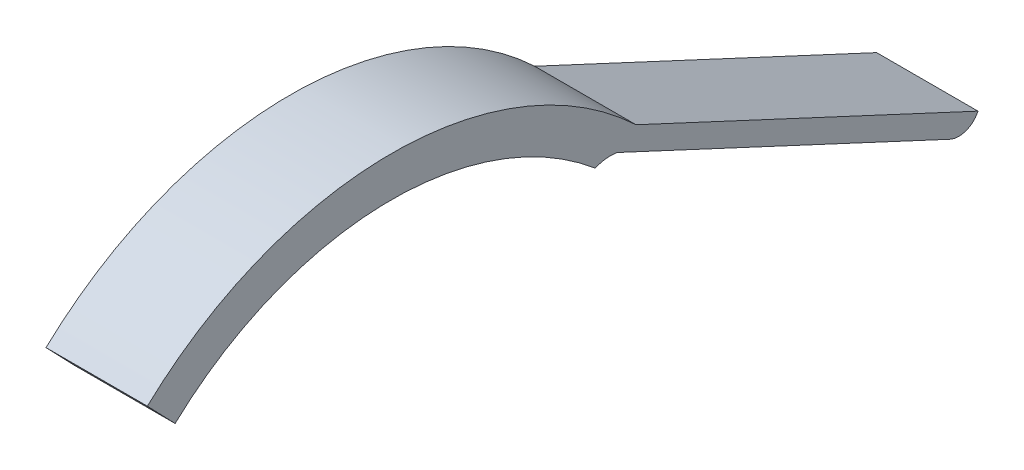
ISO-10303-21;
HEADER;
FILE_DESCRIPTION(('STEP AP214'),'2;1');
FILE_NAME('part.step','',(''),(''),'','','');
FILE_SCHEMA(('AUTOMOTIVE_DESIGN { 1 0 10303 214 1 1 1 1 }'));
ENDSEC;
DATA;
#1=APPLICATION_CONTEXT('core data for automotive mechanical design processes');
#2=APPLICATION_PROTOCOL_DEFINITION('international standard','automotive_design',2000,#1);
#3=PRODUCT_CONTEXT('',#1,'mechanical');
#4=PRODUCT('Part','Part','',(#3));
#5=PRODUCT_RELATED_PRODUCT_CATEGORY('part','',(#4));
#6=PRODUCT_DEFINITION_FORMATION('','',#4);
#7=PRODUCT_DEFINITION_CONTEXT('part definition',#1,'design');
#8=PRODUCT_DEFINITION('design','',#6,#7);
#9=PRODUCT_DEFINITION_SHAPE('','',#8);
#10=(LENGTH_UNIT() NAMED_UNIT(*) SI_UNIT(.MILLI.,.METRE.));
#11=(NAMED_UNIT(*) PLANE_ANGLE_UNIT() SI_UNIT($,.RADIAN.));
#12=(NAMED_UNIT(*) SI_UNIT($,.STERADIAN.) SOLID_ANGLE_UNIT());
#13=UNCERTAINTY_MEASURE_WITH_UNIT(LENGTH_MEASURE(1.E-05),#10,'distance_accuracy_value','');
#14=(GEOMETRIC_REPRESENTATION_CONTEXT(3) GLOBAL_UNCERTAINTY_ASSIGNED_CONTEXT((#13)) GLOBAL_UNIT_ASSIGNED_CONTEXT((#10,
#11,#12)) REPRESENTATION_CONTEXT('',''));
#15=CARTESIAN_POINT('',(0.,0.,0.));
#16=DIRECTION('',(0.,0.,1.));
#17=DIRECTION('',(1.,0.,0.));
#18=AXIS2_PLACEMENT_3D('',#15,#16,#17);
#19=CARTESIAN_POINT('',(4.3,8.76348631293942,-9.2970123977384));
#20=DIRECTION('',(-1.,0.,0.));
#21=DIRECTION('',(0.,0.,1.));
#22=AXIS2_PLACEMENT_3D('',#19,#20,#21);
#23=CYLINDRICAL_SURFACE('',#22,1.60952023246945);
#24=CARTESIAN_POINT('',(0.,8.76348631293942,-9.2970123977384));
#25=DIRECTION('',(1.,0.,0.));
#26=DIRECTION('',(0.,0.,-1.));
#27=AXIS2_PLACEMENT_3D('',#24,#25,#26);
#28=CIRCLE('',#27,1.60952023246945);
#29=CARTESIAN_POINT('',(0.,10.2361721205892,-8.64758812141704));
#30=VERTEX_POINT('',#29);
#31=CARTESIAN_POINT('',(0.,10.3483600316506,-9.57760226652773));
#32=VERTEX_POINT('',#31);
#33=EDGE_CURVE('E141',#30,#32,#28,.F.);
#34=ORIENTED_EDGE('',*,*,#33,.T.);
#35=DIRECTION('',(-1.,0.,0.));
#36=VECTOR('',#35,1.);
#37=CARTESIAN_POINT('',(4.3,10.3483600316506,-9.57760226652773));
#38=LINE('',#37,#36);
#39=CARTESIAN_POINT('',(4.3,10.3483600316506,-9.57760226652773));
#40=VERTEX_POINT('',#39);
#41=EDGE_CURVE('E11',#40,#32,#38,.T.);
#42=ORIENTED_EDGE('',*,*,#41,.F.);
#43=CARTESIAN_POINT('',(4.3,8.76348631293942,-9.2970123977384));
#44=DIRECTION('',(1.,0.,0.));
#45=DIRECTION('',(0.,0.,-1.));
#46=AXIS2_PLACEMENT_3D('',#43,#44,#45);
#47=CIRCLE('',#46,1.60952023246945);
#48=CARTESIAN_POINT('',(4.3,10.2361721205892,-8.64758812141704));
#49=VERTEX_POINT('',#48);
#50=EDGE_CURVE('E97',#49,#40,#47,.F.);
#51=ORIENTED_EDGE('',*,*,#50,.F.);
#52=DIRECTION('',(-1.,0.,0.));
#53=VECTOR('',#52,1.);
#54=CARTESIAN_POINT('',(4.3,10.2361721205892,-8.64758812141704));
#55=LINE('',#54,#53);
#56=EDGE_CURVE('E62',#49,#30,#55,.T.);
#57=ORIENTED_EDGE('',*,*,#56,.T.);
#58=EDGE_LOOP('',(#34,#42,#51,#57));
#59=FACE_BOUND('',#58,.T.);
#60=ADVANCED_FACE('F45',(#59),#23,.F.);
#61=CARTESIAN_POINT('',(4.3,12.1696142720048,-5.6655306796953));
#62=DIRECTION('',(0.,-0.906571645741513,0.422051953126062));
#63=DIRECTION('',(0.,-0.422051953126062,-0.906571645741514));
#64=AXIS2_PLACEMENT_3D('',#61,#62,#63);
#65=PLANE('',#64);
#66=DIRECTION('',(0.,0.422051953126062,0.906571645741514));
#67=VECTOR('',#66,1.);
#68=CARTESIAN_POINT('',(0.,12.1696142720048,-5.6655306796953));
#69=LINE('',#68,#67);
#70=CARTESIAN_POINT('',(0.,3.779616399596,-23.6873266283224));
#71=VERTEX_POINT('',#70);
#72=EDGE_CURVE('E144',#71,#32,#69,.T.);
#73=ORIENTED_EDGE('',*,*,#72,.F.);
#74=DIRECTION('',(-1.,0.,0.));
#75=VECTOR('',#74,1.);
#76=CARTESIAN_POINT('',(4.3,3.779616399596,-23.6873266283224));
#77=LINE('',#76,#75);
#78=CARTESIAN_POINT('',(4.3,3.779616399596,-23.6873266283224));
#79=VERTEX_POINT('',#78);
#80=EDGE_CURVE('E54',#79,#71,#77,.T.);
#81=ORIENTED_EDGE('',*,*,#80,.F.);
#82=DIRECTION('',(0.,0.422051953126062,0.906571645741514));
#83=VECTOR('',#82,1.);
#84=CARTESIAN_POINT('',(4.3,12.1696142720048,-5.6655306796953));
#85=LINE('',#84,#83);
#86=EDGE_CURVE('E188',#79,#40,#85,.T.);
#87=ORIENTED_EDGE('',*,*,#86,.T.);
#88=ORIENTED_EDGE('',*,*,#41,.T.);
#89=EDGE_LOOP('',(#73,#81,#87,#88));
#90=FACE_BOUND('',#89,.T.);
#91=ADVANCED_FACE('F182',(#90),#65,.T.);
#92=CARTESIAN_POINT('',(4.3,4.59553088076336,-24.0671733861358));
#93=DIRECTION('',(-1.,0.,0.));
#94=DIRECTION('',(0.,0.,1.));
#95=AXIS2_PLACEMENT_3D('',#92,#93,#94);
#96=CYLINDRICAL_SURFACE('',#95,0.900000000000002);
#97=CARTESIAN_POINT('',(0.,4.59553088076336,-24.0671733861358));
#98=DIRECTION('',(1.,0.,0.));
#99=DIRECTION('',(0.,0.,-1.));
#100=AXIS2_PLACEMENT_3D('',#97,#98,#99);
#101=CIRCLE('',#100,0.900000000000002);
#102=CARTESIAN_POINT('',(0.,4.21568412294991,-24.8830878673032));
#103=VERTEX_POINT('',#102);
#104=EDGE_CURVE('E148',#103,#71,#101,.F.);
#105=ORIENTED_EDGE('',*,*,#104,.F.);
#106=DIRECTION('',(-1.,0.,0.));
#107=VECTOR('',#106,1.);
#108=CARTESIAN_POINT('',(4.3,4.21568412294991,-24.8830878673032));
#109=LINE('',#108,#107);
#110=CARTESIAN_POINT('',(4.3,4.21568412294991,-24.8830878673032));
#111=VERTEX_POINT('',#110);
#112=EDGE_CURVE('E170',#111,#103,#109,.T.);
#113=ORIENTED_EDGE('',*,*,#112,.F.);
#114=CARTESIAN_POINT('',(4.3,4.59553088076336,-24.0671733861358));
#115=DIRECTION('',(1.,0.,0.));
#116=DIRECTION('',(0.,0.,-1.));
#117=AXIS2_PLACEMENT_3D('',#114,#115,#116);
#118=CIRCLE('',#117,0.900000000000002);
#119=EDGE_CURVE('E179',#111,#79,#118,.F.);
#120=ORIENTED_EDGE('',*,*,#119,.T.);
#121=ORIENTED_EDGE('',*,*,#80,.T.);
#122=EDGE_LOOP('',(#105,#113,#120,#121));
#123=FACE_BOUND('',#122,.T.);
#124=ADVANCED_FACE('F178',(#123),#96,.T.);
#125=CARTESIAN_POINT('',(4.3,12.9855287531721,-6.04537743750875));
#126=DIRECTION('',(0.,0.906571645741514,-0.422051953126062));
#127=DIRECTION('',(0.,0.422051953126062,0.906571645741514));
#128=AXIS2_PLACEMENT_3D('',#125,#126,#127);
#129=PLANE('',#128);
#130=DIRECTION('',(0.,-0.422051953126062,-0.906571645741514));
#131=VECTOR('',#130,1.);
#132=CARTESIAN_POINT('',(0.,12.9855287531721,-6.04537743750875));
#133=LINE('',#132,#131);
#134=CARTESIAN_POINT('',(0.,10.9685153729669,-10.377941535439));
#135=VERTEX_POINT('',#134);
#136=EDGE_CURVE('E152',#135,#103,#133,.T.);
#137=ORIENTED_EDGE('',*,*,#136,.F.);
#138=DIRECTION('',(-1.,0.,0.));
#139=VECTOR('',#138,1.);
#140=CARTESIAN_POINT('',(4.3,10.9685153729669,-10.377941535439));
#141=LINE('',#140,#139);
#142=CARTESIAN_POINT('',(4.3,10.9685153729669,-10.377941535439));
#143=VERTEX_POINT('',#142);
#144=EDGE_CURVE('E129',#143,#135,#141,.T.);
#145=ORIENTED_EDGE('',*,*,#144,.F.);
#146=DIRECTION('',(0.,-0.422051953126062,-0.906571645741514));
#147=VECTOR('',#146,1.);
#148=CARTESIAN_POINT('',(4.3,12.9855287531721,-6.04537743750875));
#149=LINE('',#148,#147);
#150=EDGE_CURVE('E117',#143,#111,#149,.T.);
#151=ORIENTED_EDGE('',*,*,#150,.T.);
#152=ORIENTED_EDGE('',*,*,#112,.T.);
#153=EDGE_LOOP('',(#137,#145,#151,#152));
#154=FACE_BOUND('',#153,.T.);
#155=ADVANCED_FACE('F187',(#154),#129,.T.);
#156=CARTESIAN_POINT('',(4.3,0.,0.));
#157=DIRECTION('',(-1.,0.,0.));
#158=DIRECTION('',(0.,0.,1.));
#159=AXIS2_PLACEMENT_3D('',#156,#157,#158);
#160=CYLINDRICAL_SURFACE('',#159,15.1);
#161=CARTESIAN_POINT('',(0.,0.,0.));
#162=DIRECTION('',(1.,0.,0.));
#163=DIRECTION('',(0.,0.,-1.));
#164=AXIS2_PLACEMENT_3D('',#161,#162,#163);
#165=CIRCLE('',#164,15.1);
#166=CARTESIAN_POINT('',(0.,10.9951574883045,10.3497107112896));
#167=VERTEX_POINT('',#166);
#168=EDGE_CURVE('E125',#135,#167,#165,.T.);
#169=ORIENTED_EDGE('',*,*,#168,.T.);
#170=DIRECTION('',(-1.,0.,0.));
#171=VECTOR('',#170,1.);
#172=CARTESIAN_POINT('',(4.3,10.9951574883045,10.3497107112896));
#173=LINE('',#172,#171);
#174=CARTESIAN_POINT('',(4.3,10.9951574883045,10.3497107112896));
#175=VERTEX_POINT('',#174);
#176=EDGE_CURVE('E122',#175,#167,#173,.T.);
#177=ORIENTED_EDGE('',*,*,#176,.F.);
#178=CARTESIAN_POINT('',(4.3,0.,0.));
#179=DIRECTION('',(1.,0.,0.));
#180=DIRECTION('',(0.,0.,-1.));
#181=AXIS2_PLACEMENT_3D('',#178,#179,#180);
#182=CIRCLE('',#181,15.1);
#183=EDGE_CURVE('E110',#143,#175,#182,.T.);
#184=ORIENTED_EDGE('',*,*,#183,.F.);
#185=ORIENTED_EDGE('',*,*,#144,.T.);
#186=EDGE_LOOP('',(#169,#177,#184,#185));
#187=FACE_BOUND('',#186,.T.);
#188=ADVANCED_FACE('F123',(#187),#160,.T.);
#189=CARTESIAN_POINT('',(4.3,0.103891623807916,-0.108196721311469));
#190=DIRECTION('',(0.,0.692610825386151,-0.721311475409836));
#191=DIRECTION('',(0.,0.721311475409836,0.692610825386151));
#192=AXIS2_PLACEMENT_3D('',#189,#190,#191);
#193=PLANE('',#192);
#194=DIRECTION('',(0.,-0.721311475409836,-0.692610825386151));
#195=VECTOR('',#194,1.);
#196=CARTESIAN_POINT('',(0.,0.103891623807916,-0.108196721311469));
#197=LINE('',#196,#195);
#198=CARTESIAN_POINT('',(0.,9.76885979666377,9.17220683767687));
#199=VERTEX_POINT('',#198);
#200=EDGE_CURVE('E158',#167,#199,#197,.T.);
#201=ORIENTED_EDGE('',*,*,#200,.T.);
#202=DIRECTION('',(-1.,0.,0.));
#203=VECTOR('',#202,1.);
#204=CARTESIAN_POINT('',(4.3,9.76885979666377,9.17220683767687));
#205=LINE('',#204,#203);
#206=CARTESIAN_POINT('',(4.3,9.76885979666377,9.17220683767687));
#207=VERTEX_POINT('',#206);
#208=EDGE_CURVE('E85',#207,#199,#205,.T.);
#209=ORIENTED_EDGE('',*,*,#208,.F.);
#210=DIRECTION('',(0.,-0.721311475409836,-0.692610825386151));
#211=VECTOR('',#210,1.);
#212=CARTESIAN_POINT('',(4.3,0.103891623807916,-0.108196721311469));
#213=LINE('',#212,#211);
#214=EDGE_CURVE('E114',#175,#207,#213,.T.);
#215=ORIENTED_EDGE('',*,*,#214,.F.);
#216=ORIENTED_EDGE('',*,*,#176,.T.);
#217=EDGE_LOOP('',(#201,#209,#215,#216));
#218=FACE_BOUND('',#217,.T.);
#219=ADVANCED_FACE('F131',(#218),#193,.F.);
#220=CARTESIAN_POINT('',(4.3,0.,0.));
#221=DIRECTION('',(-1.,0.,0.));
#222=DIRECTION('',(0.,0.,1.));
#223=AXIS2_PLACEMENT_3D('',#220,#221,#222);
#224=CYLINDRICAL_SURFACE('',#223,13.4);
#225=CARTESIAN_POINT('',(0.,0.,0.));
#226=DIRECTION('',(1.,0.,0.));
#227=DIRECTION('',(0.,0.,-1.));
#228=AXIS2_PLACEMENT_3D('',#225,#226,#227);
#229=CIRCLE('',#228,13.4);
#230=EDGE_CURVE('E161',#30,#199,#229,.T.);
#231=ORIENTED_EDGE('',*,*,#230,.F.);
#232=ORIENTED_EDGE('',*,*,#56,.F.);
#233=CARTESIAN_POINT('',(4.3,0.,0.));
#234=DIRECTION('',(1.,0.,0.));
#235=DIRECTION('',(0.,0.,-1.));
#236=AXIS2_PLACEMENT_3D('',#233,#234,#235);
#237=CIRCLE('',#236,13.4);
#238=EDGE_CURVE('E133',#49,#207,#237,.T.);
#239=ORIENTED_EDGE('',*,*,#238,.T.);
#240=ORIENTED_EDGE('',*,*,#208,.T.);
#241=EDGE_LOOP('',(#231,#232,#239,#240));
#242=FACE_BOUND('',#241,.T.);
#243=ADVANCED_FACE('F227',(#242),#224,.F.);
#244=CARTESIAN_POINT('',(4.3,0.,0.));
#245=DIRECTION('',(1.,0.,0.));
#246=DIRECTION('',(0.,0.,-1.));
#247=AXIS2_PLACEMENT_3D('',#244,#245,#246);
#248=PLANE('',#247);
#249=ORIENTED_EDGE('',*,*,#50,.T.);
#250=ORIENTED_EDGE('',*,*,#86,.F.);
#251=ORIENTED_EDGE('',*,*,#119,.F.);
#252=ORIENTED_EDGE('',*,*,#150,.F.);
#253=ORIENTED_EDGE('',*,*,#183,.T.);
#254=ORIENTED_EDGE('',*,*,#214,.T.);
#255=ORIENTED_EDGE('',*,*,#238,.F.);
#256=EDGE_LOOP('',(#249,#250,#251,#252,#253,#254,#255));
#257=FACE_BOUND('',#256,.T.);
#258=ADVANCED_FACE('F112',(#257),#248,.T.);
#259=CARTESIAN_POINT('',(0.,0.,0.));
#260=DIRECTION('',(1.,0.,0.));
#261=DIRECTION('',(0.,0.,-1.));
#262=AXIS2_PLACEMENT_3D('',#259,#260,#261);
#263=PLANE('',#262);
#264=ORIENTED_EDGE('',*,*,#33,.F.);
#265=ORIENTED_EDGE('',*,*,#230,.T.);
#266=ORIENTED_EDGE('',*,*,#200,.F.);
#267=ORIENTED_EDGE('',*,*,#168,.F.);
#268=ORIENTED_EDGE('',*,*,#136,.T.);
#269=ORIENTED_EDGE('',*,*,#104,.T.);
#270=ORIENTED_EDGE('',*,*,#72,.T.);
#271=EDGE_LOOP('',(#264,#265,#266,#267,#268,#269,#270));
#272=FACE_BOUND('',#271,.T.);
#273=ADVANCED_FACE('F184',(#272),#263,.F.);
#274=CLOSED_SHELL('',(#60,#91,#124,#155,#188,#219,#243,#258,#273));
#275=MANIFOLD_SOLID_BREP('B2',#274);
#276=ADVANCED_BREP_SHAPE_REPRESENTATION('',(#18,#275),#14);
#277=SHAPE_DEFINITION_REPRESENTATION(#9,#276);
ENDSEC;
END-ISO-10303-21;
